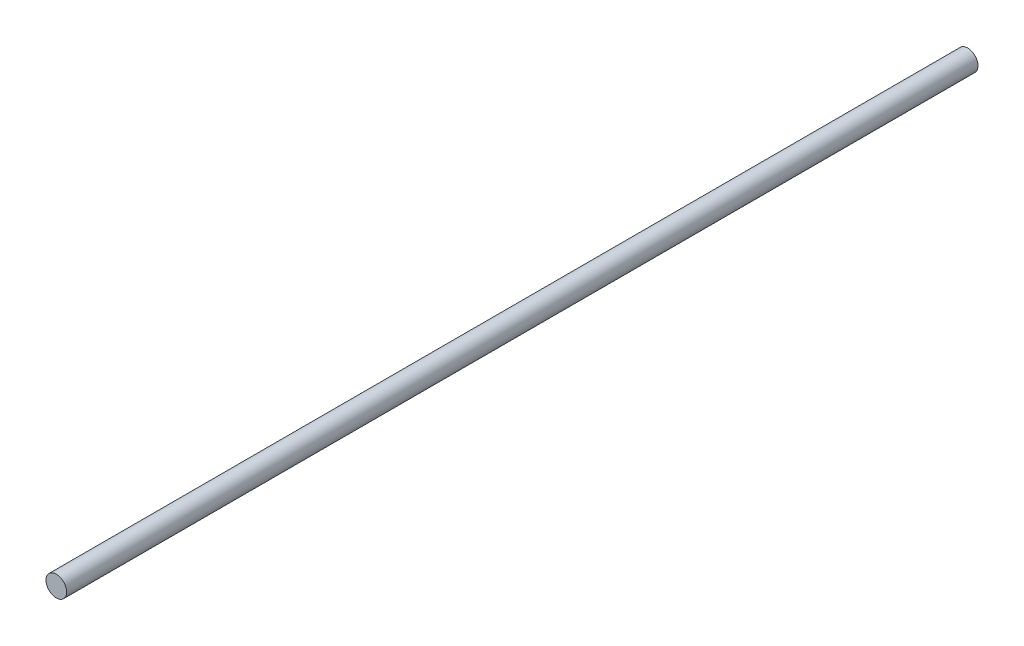
ISO-10303-21;
HEADER;
FILE_DESCRIPTION(('STEP AP214'),'2;1');
FILE_NAME('part.step','',(''),(''),'','','');
FILE_SCHEMA(('AUTOMOTIVE_DESIGN { 1 0 10303 214 1 1 1 1 }'));
ENDSEC;
DATA;
#1=APPLICATION_CONTEXT('core data for automotive mechanical design processes');
#2=APPLICATION_PROTOCOL_DEFINITION('international standard','automotive_design',2000,#1);
#3=PRODUCT_CONTEXT('',#1,'mechanical');
#4=PRODUCT('Part','Part','',(#3));
#5=PRODUCT_RELATED_PRODUCT_CATEGORY('part','',(#4));
#6=PRODUCT_DEFINITION_FORMATION('','',#4);
#7=PRODUCT_DEFINITION_CONTEXT('part definition',#1,'design');
#8=PRODUCT_DEFINITION('design','',#6,#7);
#9=PRODUCT_DEFINITION_SHAPE('','',#8);
#10=(LENGTH_UNIT() NAMED_UNIT(*) SI_UNIT(.MILLI.,.METRE.));
#11=(NAMED_UNIT(*) PLANE_ANGLE_UNIT() SI_UNIT($,.RADIAN.));
#12=(NAMED_UNIT(*) SI_UNIT($,.STERADIAN.) SOLID_ANGLE_UNIT());
#13=UNCERTAINTY_MEASURE_WITH_UNIT(LENGTH_MEASURE(1.E-05),#10,'distance_accuracy_value','');
#14=(GEOMETRIC_REPRESENTATION_CONTEXT(3) GLOBAL_UNCERTAINTY_ASSIGNED_CONTEXT((#13)) GLOBAL_UNIT_ASSIGNED_CONTEXT((#10,
#11,#12)) REPRESENTATION_CONTEXT('',''));
#15=CARTESIAN_POINT('',(0.,0.,0.));
#16=DIRECTION('',(0.,0.,1.));
#17=DIRECTION('',(1.,0.,0.));
#18=AXIS2_PLACEMENT_3D('',#15,#16,#17);
#19=CARTESIAN_POINT('',(0.,0.,265.));
#20=DIRECTION('',(0.,0.,-1.));
#21=DIRECTION('',(-1.,0.,0.));
#22=AXIS2_PLACEMENT_3D('',#19,#20,#21);
#23=CYLINDRICAL_SURFACE('',#22,3.);
#24=CARTESIAN_POINT('',(0.,0.,265.));
#25=DIRECTION('',(0.,0.,1.));
#26=DIRECTION('',(1.,0.,0.));
#27=AXIS2_PLACEMENT_3D('',#24,#25,#26);
#28=CIRCLE('',#27,3.);
#29=CARTESIAN_POINT('',(3.,0.,265.));
#30=VERTEX_POINT('',#29);
#31=EDGE_CURVE('E10',#30,#30,#28,.T.);
#32=ORIENTED_EDGE('',*,*,#31,.F.);
#33=EDGE_LOOP('',(#32));
#34=FACE_BOUND('',#33,.T.);
#35=CARTESIAN_POINT('',(0.,0.,0.));
#36=DIRECTION('',(0.,0.,1.));
#37=DIRECTION('',(1.,0.,0.));
#38=AXIS2_PLACEMENT_3D('',#35,#36,#37);
#39=CIRCLE('',#38,3.);
#40=CARTESIAN_POINT('',(3.,0.,0.));
#41=VERTEX_POINT('',#40);
#42=EDGE_CURVE('E32',#41,#41,#39,.T.);
#43=ORIENTED_EDGE('',*,*,#42,.T.);
#44=EDGE_LOOP('',(#43));
#45=FACE_BOUND('',#44,.T.);
#46=ADVANCED_FACE('F29',(#34,#45),#23,.T.);
#47=CARTESIAN_POINT('',(0.,0.,265.));
#48=DIRECTION('',(0.,0.,1.));
#49=DIRECTION('',(1.,0.,0.));
#50=AXIS2_PLACEMENT_3D('',#47,#48,#49);
#51=PLANE('',#50);
#52=ORIENTED_EDGE('',*,*,#31,.T.);
#53=EDGE_LOOP('',(#52));
#54=FACE_BOUND('',#53,.T.);
#55=ADVANCED_FACE('F44',(#54),#51,.T.);
#56=CARTESIAN_POINT('',(0.,0.,0.));
#57=DIRECTION('',(0.,0.,1.));
#58=DIRECTION('',(1.,0.,0.));
#59=AXIS2_PLACEMENT_3D('',#56,#57,#58);
#60=PLANE('',#59);
#61=ORIENTED_EDGE('',*,*,#42,.F.);
#62=EDGE_LOOP('',(#61));
#63=FACE_BOUND('',#62,.T.);
#64=ADVANCED_FACE('F42',(#63),#60,.F.);
#65=CLOSED_SHELL('',(#46,#55,#64));
#66=MANIFOLD_SOLID_BREP('B2',#65);
#67=ADVANCED_BREP_SHAPE_REPRESENTATION('',(#18,#66),#14);
#68=SHAPE_DEFINITION_REPRESENTATION(#9,#67);
ENDSEC;
END-ISO-10303-21;
